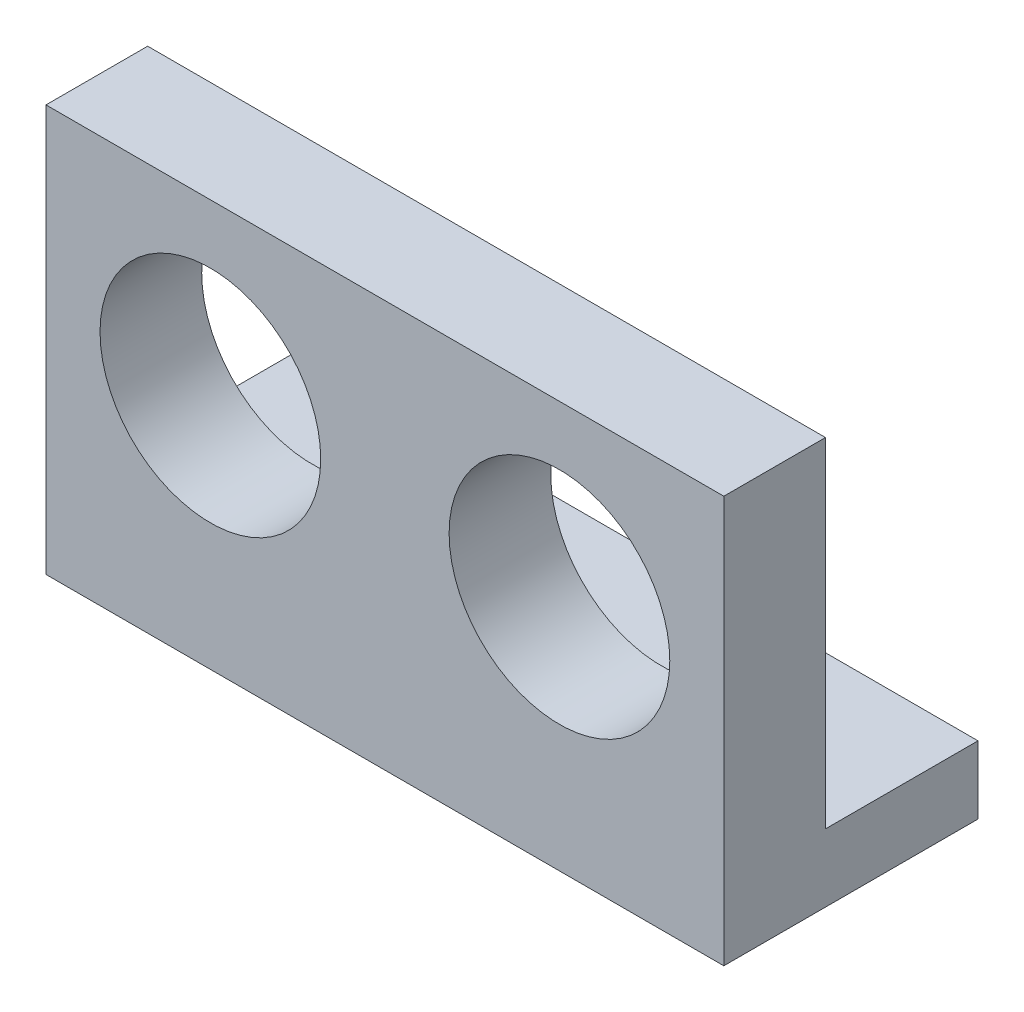
ISO-10303-21;
HEADER;
FILE_DESCRIPTION(('STEP AP214'),'2;1');
FILE_NAME('part.step','',(''),(''),'','','');
FILE_SCHEMA(('AUTOMOTIVE_DESIGN { 1 0 10303 214 1 1 1 1 }'));
ENDSEC;
DATA;
#1=APPLICATION_CONTEXT('core data for automotive mechanical design processes');
#2=APPLICATION_PROTOCOL_DEFINITION('international standard','automotive_design',2000,#1);
#3=PRODUCT_CONTEXT('',#1,'mechanical');
#4=PRODUCT('Part','Part','',(#3));
#5=PRODUCT_RELATED_PRODUCT_CATEGORY('part','',(#4));
#6=PRODUCT_DEFINITION_FORMATION('','',#4);
#7=PRODUCT_DEFINITION_CONTEXT('part definition',#1,'design');
#8=PRODUCT_DEFINITION('design','',#6,#7);
#9=PRODUCT_DEFINITION_SHAPE('','',#8);
#10=(LENGTH_UNIT() NAMED_UNIT(*) SI_UNIT(.MILLI.,.METRE.));
#11=(NAMED_UNIT(*) PLANE_ANGLE_UNIT() SI_UNIT($,.RADIAN.));
#12=(NAMED_UNIT(*) SI_UNIT($,.STERADIAN.) SOLID_ANGLE_UNIT());
#13=UNCERTAINTY_MEASURE_WITH_UNIT(LENGTH_MEASURE(1.E-05),#10,'distance_accuracy_value','');
#14=(GEOMETRIC_REPRESENTATION_CONTEXT(3) GLOBAL_UNCERTAINTY_ASSIGNED_CONTEXT((#13)) GLOBAL_UNIT_ASSIGNED_CONTEXT((#10,
#11,#12)) REPRESENTATION_CONTEXT('',''));
#15=CARTESIAN_POINT('',(0.,0.,0.));
#16=DIRECTION('',(0.,0.,1.));
#17=DIRECTION('',(1.,0.,0.));
#18=AXIS2_PLACEMENT_3D('',#15,#16,#17);
#19=CARTESIAN_POINT('',(25.4,0.,7.62000000000001));
#20=DIRECTION('',(-1.,0.,0.));
#21=DIRECTION('',(0.,0.,1.));
#22=AXIS2_PLACEMENT_3D('',#19,#20,#21);
#23=PLANE('',#22);
#24=DIRECTION('',(0.,1.,0.));
#25=VECTOR('',#24,1.);
#26=CARTESIAN_POINT('',(25.4,0.,0.));
#27=LINE('',#26,#25);
#28=CARTESIAN_POINT('',(25.4,0.,0.));
#29=VERTEX_POINT('',#28);
#30=CARTESIAN_POINT('',(25.4,25.4,0.));
#31=VERTEX_POINT('',#30);
#32=EDGE_CURVE('E98',#29,#31,#27,.T.);
#33=ORIENTED_EDGE('',*,*,#32,.T.);
#34=DIRECTION('',(0.,0.,-1.));
#35=VECTOR('',#34,1.);
#36=CARTESIAN_POINT('',(25.4,25.4,7.61999999999998));
#37=LINE('',#36,#35);
#38=CARTESIAN_POINT('',(25.4,25.4,7.61999999999998));
#39=VERTEX_POINT('',#38);
#40=EDGE_CURVE('E13',#39,#31,#37,.T.);
#41=ORIENTED_EDGE('',*,*,#40,.F.);
#42=DIRECTION('',(0.,1.,0.));
#43=VECTOR('',#42,1.);
#44=CARTESIAN_POINT('',(25.4,0.,7.62000000000001));
#45=LINE('',#44,#43);
#46=CARTESIAN_POINT('',(25.4,-5.07999999999993,7.61999999999995));
#47=VERTEX_POINT('',#46);
#48=EDGE_CURVE('E102',#47,#39,#45,.T.);
#49=ORIENTED_EDGE('',*,*,#48,.F.);
#50=DIRECTION('',(0.,0.,1.));
#51=VECTOR('',#50,1.);
#52=CARTESIAN_POINT('',(25.4,-5.07999999999993,7.61999999999995));
#53=LINE('',#52,#51);
#54=CARTESIAN_POINT('',(25.4,-5.07999999999996,-11.43));
#55=VERTEX_POINT('',#54);
#56=EDGE_CURVE('E110',#55,#47,#53,.T.);
#57=ORIENTED_EDGE('',*,*,#56,.F.);
#58=DIRECTION('',(0.,1.,0.));
#59=VECTOR('',#58,1.);
#60=CARTESIAN_POINT('',(25.4,-5.07999999999996,-11.43));
#61=LINE('',#60,#59);
#62=CARTESIAN_POINT('',(25.4,0.,-11.43));
#63=VERTEX_POINT('',#62);
#64=EDGE_CURVE('E115',#55,#63,#61,.T.);
#65=ORIENTED_EDGE('',*,*,#64,.T.);
#66=DIRECTION('',(0.,0.,1.));
#67=VECTOR('',#66,1.);
#68=CARTESIAN_POINT('',(25.4,0.,7.62000000000001));
#69=LINE('',#68,#67);
#70=EDGE_CURVE('E108',#63,#29,#69,.T.);
#71=ORIENTED_EDGE('',*,*,#70,.T.);
#72=EDGE_LOOP('',(#33,#41,#49,#57,#65,#71));
#73=FACE_BOUND('',#72,.T.);
#74=ADVANCED_FACE('F49',(#73),#23,.F.);
#75=CARTESIAN_POINT('',(-25.4,25.4,7.62000000000001));
#76=DIRECTION('',(0.,-1.,0.));
#77=DIRECTION('',(0.,0.,-1.));
#78=AXIS2_PLACEMENT_3D('',#75,#76,#77);
#79=PLANE('',#78);
#80=DIRECTION('',(-1.,0.,0.));
#81=VECTOR('',#80,1.);
#82=CARTESIAN_POINT('',(-25.4,25.4,0.));
#83=LINE('',#82,#81);
#84=CARTESIAN_POINT('',(-25.4,25.4,0.));
#85=VERTEX_POINT('',#84);
#86=EDGE_CURVE('E76',#31,#85,#83,.T.);
#87=ORIENTED_EDGE('',*,*,#86,.T.);
#88=DIRECTION('',(0.,0.,-1.));
#89=VECTOR('',#88,1.);
#90=CARTESIAN_POINT('',(-25.4,25.4,7.62000000000001));
#91=LINE('',#90,#89);
#92=CARTESIAN_POINT('',(-25.4,25.4,7.62000000000001));
#93=VERTEX_POINT('',#92);
#94=EDGE_CURVE('E57',#93,#85,#91,.T.);
#95=ORIENTED_EDGE('',*,*,#94,.F.);
#96=DIRECTION('',(-1.,0.,0.));
#97=VECTOR('',#96,1.);
#98=CARTESIAN_POINT('',(-25.4,25.4,7.62000000000001));
#99=LINE('',#98,#97);
#100=EDGE_CURVE('E65',#39,#93,#99,.T.);
#101=ORIENTED_EDGE('',*,*,#100,.F.);
#102=ORIENTED_EDGE('',*,*,#40,.T.);
#103=EDGE_LOOP('',(#87,#95,#101,#102));
#104=FACE_BOUND('',#103,.T.);
#105=ADVANCED_FACE('F184',(#104),#79,.F.);
#106=CARTESIAN_POINT('',(-25.4,0.,7.61999999999998));
#107=DIRECTION('',(1.,0.,0.));
#108=DIRECTION('',(0.,0.,-1.));
#109=AXIS2_PLACEMENT_3D('',#106,#107,#108);
#110=PLANE('',#109);
#111=DIRECTION('',(0.,-1.,0.));
#112=VECTOR('',#111,1.);
#113=CARTESIAN_POINT('',(-25.4,0.,0.));
#114=LINE('',#113,#112);
#115=CARTESIAN_POINT('',(-25.4,0.,0.));
#116=VERTEX_POINT('',#115);
#117=EDGE_CURVE('E82',#85,#116,#114,.T.);
#118=ORIENTED_EDGE('',*,*,#117,.T.);
#119=DIRECTION('',(0.,0.,-1.));
#120=VECTOR('',#119,1.);
#121=CARTESIAN_POINT('',(-25.4,0.,7.61999999999998));
#122=LINE('',#121,#120);
#123=CARTESIAN_POINT('',(-25.4,0.,-11.43));
#124=VERTEX_POINT('',#123);
#125=EDGE_CURVE('E88',#116,#124,#122,.T.);
#126=ORIENTED_EDGE('',*,*,#125,.T.);
#127=DIRECTION('',(0.,1.,0.));
#128=VECTOR('',#127,1.);
#129=CARTESIAN_POINT('',(-25.4,-5.08000000000002,-11.43));
#130=LINE('',#129,#128);
#131=CARTESIAN_POINT('',(-25.4,-5.08000000000002,-11.43));
#132=VERTEX_POINT('',#131);
#133=EDGE_CURVE('E118',#132,#124,#130,.T.);
#134=ORIENTED_EDGE('',*,*,#133,.F.);
#135=DIRECTION('',(0.,0.,-1.));
#136=VECTOR('',#135,1.);
#137=CARTESIAN_POINT('',(-25.4,-5.08000000000002,7.61999999999998));
#138=LINE('',#137,#136);
#139=CARTESIAN_POINT('',(-25.4,-5.08000000000002,7.61999999999998));
#140=VERTEX_POINT('',#139);
#141=EDGE_CURVE('E165',#140,#132,#138,.T.);
#142=ORIENTED_EDGE('',*,*,#141,.F.);
#143=DIRECTION('',(0.,-1.,0.));
#144=VECTOR('',#143,1.);
#145=CARTESIAN_POINT('',(-25.4,0.,7.61999999999998));
#146=LINE('',#145,#144);
#147=EDGE_CURVE('E135',#93,#140,#146,.T.);
#148=ORIENTED_EDGE('',*,*,#147,.F.);
#149=ORIENTED_EDGE('',*,*,#94,.T.);
#150=EDGE_LOOP('',(#118,#126,#134,#142,#148,#149));
#151=FACE_BOUND('',#150,.T.);
#152=ADVANCED_FACE('F84',(#151),#110,.F.);
#153=CARTESIAN_POINT('',(0.,0.,7.62000000000002));
#154=DIRECTION('',(0.,0.,-1.));
#155=DIRECTION('',(-1.,0.,0.));
#156=AXIS2_PLACEMENT_3D('',#153,#154,#155);
#157=PLANE('',#156);
#158=CARTESIAN_POINT('',(13.081,12.7,7.62000000000002));
#159=DIRECTION('',(0.,0.,1.));
#160=DIRECTION('',(1.,0.,0.));
#161=AXIS2_PLACEMENT_3D('',#158,#159,#160);
#162=CIRCLE('',#161,8.2696685);
#163=CARTESIAN_POINT('',(21.3506685,12.7,7.62000000000002));
#164=VERTEX_POINT('',#163);
#165=EDGE_CURVE('E122',#164,#164,#162,.T.);
#166=ORIENTED_EDGE('',*,*,#165,.F.);
#167=EDGE_LOOP('',(#166));
#168=FACE_BOUND('',#167,.T.);
#169=CARTESIAN_POINT('',(-13.081,12.7,7.61999999999999));
#170=DIRECTION('',(0.,0.,1.));
#171=DIRECTION('',(1.,0.,0.));
#172=AXIS2_PLACEMENT_3D('',#169,#170,#171);
#173=CIRCLE('',#172,8.2696685);
#174=CARTESIAN_POINT('',(-4.81133149999999,12.7,7.61999999999999));
#175=VERTEX_POINT('',#174);
#176=EDGE_CURVE('E121',#175,#175,#173,.T.);
#177=ORIENTED_EDGE('',*,*,#176,.F.);
#178=EDGE_LOOP('',(#177));
#179=FACE_BOUND('',#178,.T.);
#180=ORIENTED_EDGE('',*,*,#48,.T.);
#181=ORIENTED_EDGE('',*,*,#100,.T.);
#182=ORIENTED_EDGE('',*,*,#147,.T.);
#183=DIRECTION('',(-1.,0.,0.));
#184=VECTOR('',#183,1.);
#185=CARTESIAN_POINT('',(25.4,-5.07999999999993,7.61999999999995));
#186=LINE('',#185,#184);
#187=EDGE_CURVE('E160',#47,#140,#186,.T.);
#188=ORIENTED_EDGE('',*,*,#187,.F.);
#189=EDGE_LOOP('',(#180,#181,#182,#188));
#190=FACE_BOUND('',#189,.T.);
#191=ADVANCED_FACE('F159',(#168,#179,#190),#157,.F.);
#192=CARTESIAN_POINT('',(0.,0.,0.));
#193=DIRECTION('',(0.,0.,-1.));
#194=DIRECTION('',(-1.,0.,0.));
#195=AXIS2_PLACEMENT_3D('',#192,#193,#194);
#196=PLANE('',#195);
#197=CARTESIAN_POINT('',(13.081,12.7,0.));
#198=DIRECTION('',(0.,0.,1.));
#199=DIRECTION('',(1.,0.,0.));
#200=AXIS2_PLACEMENT_3D('',#197,#198,#199);
#201=CIRCLE('',#200,8.2696685);
#202=CARTESIAN_POINT('',(21.3506685,12.7,0.));
#203=VERTEX_POINT('',#202);
#204=EDGE_CURVE('E125',#203,#203,#201,.T.);
#205=ORIENTED_EDGE('',*,*,#204,.T.);
#206=EDGE_LOOP('',(#205));
#207=FACE_BOUND('',#206,.T.);
#208=CARTESIAN_POINT('',(-13.081,12.7,0.));
#209=DIRECTION('',(0.,0.,1.));
#210=DIRECTION('',(1.,0.,0.));
#211=AXIS2_PLACEMENT_3D('',#208,#209,#210);
#212=CIRCLE('',#211,8.2696685);
#213=CARTESIAN_POINT('',(-4.81133150000001,12.7,0.));
#214=VERTEX_POINT('',#213);
#215=EDGE_CURVE('E128',#214,#214,#212,.T.);
#216=ORIENTED_EDGE('',*,*,#215,.T.);
#217=EDGE_LOOP('',(#216));
#218=FACE_BOUND('',#217,.T.);
#219=ORIENTED_EDGE('',*,*,#32,.F.);
#220=DIRECTION('',(1.,0.,0.));
#221=VECTOR('',#220,1.);
#222=CARTESIAN_POINT('',(-25.4,0.,0.));
#223=LINE('',#222,#221);
#224=EDGE_CURVE('E92',#116,#29,#223,.T.);
#225=ORIENTED_EDGE('',*,*,#224,.F.);
#226=ORIENTED_EDGE('',*,*,#117,.F.);
#227=ORIENTED_EDGE('',*,*,#86,.F.);
#228=EDGE_LOOP('',(#219,#225,#226,#227));
#229=FACE_BOUND('',#228,.T.);
#230=ADVANCED_FACE('F96',(#207,#218,#229),#196,.T.);
#231=CARTESIAN_POINT('',(-13.081,12.7,7.61999999999999));
#232=DIRECTION('',(0.,0.,-1.));
#233=DIRECTION('',(-1.,0.,0.));
#234=AXIS2_PLACEMENT_3D('',#231,#232,#233);
#235=CYLINDRICAL_SURFACE('',#234,8.2696685);
#236=ORIENTED_EDGE('',*,*,#176,.T.);
#237=EDGE_LOOP('',(#236));
#238=FACE_BOUND('',#237,.T.);
#239=ORIENTED_EDGE('',*,*,#215,.F.);
#240=EDGE_LOOP('',(#239));
#241=FACE_BOUND('',#240,.T.);
#242=ADVANCED_FACE('F179',(#238,#241),#235,.F.);
#243=CARTESIAN_POINT('',(13.081,12.7,7.62000000000002));
#244=DIRECTION('',(0.,0.,-1.));
#245=DIRECTION('',(-1.,0.,0.));
#246=AXIS2_PLACEMENT_3D('',#243,#244,#245);
#247=CYLINDRICAL_SURFACE('',#246,8.2696685);
#248=ORIENTED_EDGE('',*,*,#165,.T.);
#249=EDGE_LOOP('',(#248));
#250=FACE_BOUND('',#249,.T.);
#251=ORIENTED_EDGE('',*,*,#204,.F.);
#252=EDGE_LOOP('',(#251));
#253=FACE_BOUND('',#252,.T.);
#254=ADVANCED_FACE('F172',(#250,#253),#247,.F.);
#255=CARTESIAN_POINT('',(25.4,-5.07999999999996,-11.43));
#256=DIRECTION('',(0.,0.,1.));
#257=DIRECTION('',(1.,0.,0.));
#258=AXIS2_PLACEMENT_3D('',#255,#256,#257);
#259=PLANE('',#258);
#260=DIRECTION('',(1.,0.,0.));
#261=VECTOR('',#260,1.);
#262=CARTESIAN_POINT('',(25.4,0.,-11.43));
#263=LINE('',#262,#261);
#264=EDGE_CURVE('E107',#124,#63,#263,.T.);
#265=ORIENTED_EDGE('',*,*,#264,.T.);
#266=ORIENTED_EDGE('',*,*,#64,.F.);
#267=DIRECTION('',(1.,0.,0.));
#268=VECTOR('',#267,1.);
#269=CARTESIAN_POINT('',(25.4,-5.07999999999996,-11.43));
#270=LINE('',#269,#268);
#271=EDGE_CURVE('E119',#132,#55,#270,.T.);
#272=ORIENTED_EDGE('',*,*,#271,.F.);
#273=ORIENTED_EDGE('',*,*,#133,.T.);
#274=EDGE_LOOP('',(#265,#266,#272,#273));
#275=FACE_BOUND('',#274,.T.);
#276=ADVANCED_FACE('F170',(#275),#259,.F.);
#277=CARTESIAN_POINT('',(0.,-5.08000000000002,0.));
#278=DIRECTION('',(0.,1.,0.));
#279=DIRECTION('',(0.,0.,1.));
#280=AXIS2_PLACEMENT_3D('',#277,#278,#279);
#281=PLANE('',#280);
#282=ORIENTED_EDGE('',*,*,#56,.T.);
#283=ORIENTED_EDGE('',*,*,#187,.T.);
#284=ORIENTED_EDGE('',*,*,#141,.T.);
#285=ORIENTED_EDGE('',*,*,#271,.T.);
#286=EDGE_LOOP('',(#282,#283,#284,#285));
#287=FACE_BOUND('',#286,.T.);
#288=ADVANCED_FACE('F164',(#287),#281,.F.);
#289=CARTESIAN_POINT('',(0.,0.,0.));
#290=DIRECTION('',(0.,1.,0.));
#291=DIRECTION('',(0.,0.,1.));
#292=AXIS2_PLACEMENT_3D('',#289,#290,#291);
#293=PLANE('',#292);
#294=ORIENTED_EDGE('',*,*,#125,.F.);
#295=ORIENTED_EDGE('',*,*,#224,.T.);
#296=ORIENTED_EDGE('',*,*,#70,.F.);
#297=ORIENTED_EDGE('',*,*,#264,.F.);
#298=EDGE_LOOP('',(#294,#295,#296,#297));
#299=FACE_BOUND('',#298,.T.);
#300=ADVANCED_FACE('F105',(#299),#293,.T.);
#301=CLOSED_SHELL('',(#74,#105,#152,#191,#230,#242,#254,#276,#288,#300));
#302=MANIFOLD_SOLID_BREP('B2',#301);
#303=ADVANCED_BREP_SHAPE_REPRESENTATION('',(#18,#302),#14);
#304=SHAPE_DEFINITION_REPRESENTATION(#9,#303);
ENDSEC;
END-ISO-10303-21;
